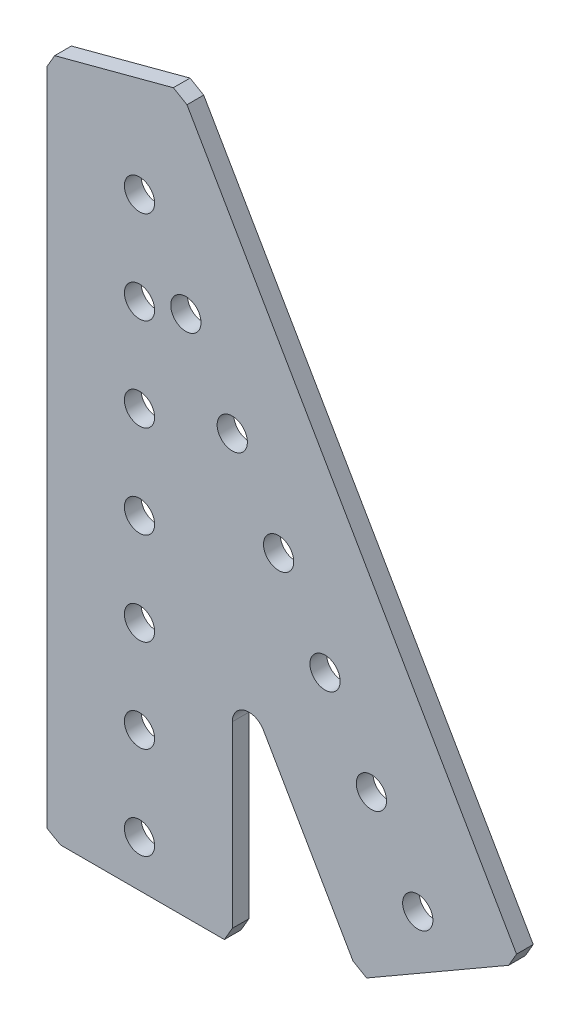
ISO-10303-21;
HEADER;
FILE_DESCRIPTION(('STEP AP214'),'2;1');
FILE_NAME('part.step','',(''),(''),'','','');
FILE_SCHEMA(('AUTOMOTIVE_DESIGN { 1 0 10303 214 1 1 1 1 }'));
ENDSEC;
DATA;
#1=APPLICATION_CONTEXT('core data for automotive mechanical design processes');
#2=APPLICATION_PROTOCOL_DEFINITION('international standard','automotive_design',2000,#1);
#3=PRODUCT_CONTEXT('',#1,'mechanical');
#4=PRODUCT('Part','Part','',(#3));
#5=PRODUCT_RELATED_PRODUCT_CATEGORY('part','',(#4));
#6=PRODUCT_DEFINITION_FORMATION('','',#4);
#7=PRODUCT_DEFINITION_CONTEXT('part definition',#1,'design');
#8=PRODUCT_DEFINITION('design','',#6,#7);
#9=PRODUCT_DEFINITION_SHAPE('','',#8);
#10=(LENGTH_UNIT() NAMED_UNIT(*) SI_UNIT(.MILLI.,.METRE.));
#11=(NAMED_UNIT(*) PLANE_ANGLE_UNIT() SI_UNIT($,.RADIAN.));
#12=(NAMED_UNIT(*) SI_UNIT($,.STERADIAN.) SOLID_ANGLE_UNIT());
#13=UNCERTAINTY_MEASURE_WITH_UNIT(LENGTH_MEASURE(1.E-05),#10,'distance_accuracy_value','');
#14=(GEOMETRIC_REPRESENTATION_CONTEXT(3) GLOBAL_UNCERTAINTY_ASSIGNED_CONTEXT((#13)) GLOBAL_UNIT_ASSIGNED_CONTEXT((#10,
#11,#12)) REPRESENTATION_CONTEXT('',''));
#15=CARTESIAN_POINT('',(0.,0.,0.));
#16=DIRECTION('',(0.,0.,1.));
#17=DIRECTION('',(1.,0.,0.));
#18=AXIS2_PLACEMENT_3D('',#15,#16,#17);
#19=CARTESIAN_POINT('',(52.1635374017813,-65.2038970824057,0.));
#20=DIRECTION('',(0.,0.,1.));
#21=DIRECTION('',(1.,0.,0.));
#22=AXIS2_PLACEMENT_3D('',#19,#20,#21);
#23=PLANE('',#22);
#24=DIRECTION('',(0.5,-0.866025403784438,0.));
#25=VECTOR('',#24,1.);
#26=CARTESIAN_POINT('',(-11.1085078543435,-6.41350000000027,0.));
#27=LINE('',#26,#25);
#28=CARTESIAN_POINT('',(16.9657340730513,-55.0395134022283,0.));
#29=VERTEX_POINT('',#28);
#30=CARTESIAN_POINT('',(29.2306376524861,-76.2829495517427,0.));
#31=VERTEX_POINT('',#30);
#32=EDGE_CURVE('E54',#29,#31,#27,.T.);
#33=ORIENTED_EDGE('',*,*,#32,.F.);
#34=CARTESIAN_POINT('',(14.986,-56.1825134022283,0.));
#35=DIRECTION('',(0.,0.,1.));
#36=DIRECTION('',(1.,0.,0.));
#37=AXIS2_PLACEMENT_3D('',#34,#35,#36);
#38=CIRCLE('',#37,2.286);
#39=CARTESIAN_POINT('',(12.7,-56.1825134022283,0.));
#40=VERTEX_POINT('',#39);
#41=EDGE_CURVE('E252',#29,#40,#38,.T.);
#42=ORIENTED_EDGE('',*,*,#41,.T.);
#43=DIRECTION('',(0.,1.,0.));
#44=VECTOR('',#43,1.);
#45=CARTESIAN_POINT('',(12.7,0.,0.));
#46=LINE('',#45,#44);
#47=CARTESIAN_POINT('',(12.7,-80.68221747697,0.));
#48=VERTEX_POINT('',#47);
#49=EDGE_CURVE('E60',#40,#48,#46,.F.);
#50=ORIENTED_EDGE('',*,*,#49,.T.);
#51=DIRECTION('',(-0.501574169410907,-0.865114647072721,0.));
#52=VECTOR('',#51,1.);
#53=CARTESIAN_POINT('',(44.5145366567396,-25.8085351182809,0.));
#54=LINE('',#53,#52);
#55=CARTESIAN_POINT('',(11.6171013682419,-82.55,0.));
#56=VERTEX_POINT('',#55);
#57=EDGE_CURVE('E154',#48,#56,#54,.T.);
#58=ORIENTED_EDGE('',*,*,#57,.T.);
#59=DIRECTION('',(-1.,0.,0.));
#60=VECTOR('',#59,1.);
#61=CARTESIAN_POINT('',(12.7,-82.55,0.));
#62=LINE('',#61,#60);
#63=CARTESIAN_POINT('',(-10.83221747697,-82.55,0.));
#64=VERTEX_POINT('',#63);
#65=EDGE_CURVE('E163',#56,#64,#62,.T.);
#66=ORIENTED_EDGE('',*,*,#65,.T.);
#67=DIRECTION('',(0.865114647072719,-0.501574169410911,0.));
#68=VECTOR('',#67,1.);
#69=CARTESIAN_POINT('',(-38.5451596604444,-66.4826544699684,0.));
#70=LINE('',#69,#68);
#71=CARTESIAN_POINT('',(-12.7,-81.4671013682419,0.));
#72=VERTEX_POINT('',#71);
#73=EDGE_CURVE('E169',#72,#64,#70,.T.);
#74=ORIENTED_EDGE('',*,*,#73,.F.);
#75=DIRECTION('',(0.,1.,0.));
#76=VECTOR('',#75,1.);
#77=CARTESIAN_POINT('',(-12.7,-82.55,0.));
#78=LINE('',#77,#76);
#79=CARTESIAN_POINT('',(-12.7,8.77953534918344,0.));
#80=VERTEX_POINT('',#79);
#81=EDGE_CURVE('E175',#72,#80,#78,.T.);
#82=ORIENTED_EDGE('',*,*,#81,.T.);
#83=DIRECTION('',(0.501574169410909,0.86511464707272,0.));
#84=VECTOR('',#83,1.);
#85=CARTESIAN_POINT('',(-13.3145851865059,7.71949940804912,0.));
#86=LINE('',#85,#84);
#87=CARTESIAN_POINT('',(-11.6171013682418,10.6473178722135,0.));
#88=VERTEX_POINT('',#87);
#89=EDGE_CURVE('E177',#80,#88,#86,.T.);
#90=ORIENTED_EDGE('',*,*,#89,.T.);
#91=DIRECTION('',(0.966394929907391,0.257061936990462,0.));
#92=VECTOR('',#91,1.);
#93=CARTESIAN_POINT('',(-12.7,10.359265843763,0.));
#94=LINE('',#93,#92);
#95=CARTESIAN_POINT('',(4.63267632701637,14.969773630966,0.));
#96=VERTEX_POINT('',#95);
#97=EDGE_CURVE('E185',#88,#96,#94,.T.);
#98=ORIENTED_EDGE('',*,*,#97,.T.);
#99=DIRECTION('',(0.86511464707272,-0.501574169410908,0.));
#100=VECTOR('',#99,1.);
#101=CARTESIAN_POINT('',(7.66114478651684,13.2139351911697,0.));
#102=LINE('',#101,#100);
#103=CARTESIAN_POINT('',(6.50045885004739,13.8868749992073,0.));
#104=VERTEX_POINT('',#103);
#105=EDGE_CURVE('E191',#96,#104,#102,.T.);
#106=ORIENTED_EDGE('',*,*,#105,.T.);
#107=DIRECTION('',(0.499999999999995,-0.866025403784442,0.));
#108=VECTOR('',#107,1.);
#109=CARTESIAN_POINT('',(5.70982341473581,15.2562957434313,0.));
#110=LINE('',#109,#108);
#111=CARTESIAN_POINT('',(51.6254885028765,-64.2719690525461,0.));
#112=VERTEX_POINT('',#111);
#113=EDGE_CURVE('E197',#104,#112,#110,.T.);
#114=ORIENTED_EDGE('',*,*,#113,.T.);
#115=DIRECTION('',(0.50157416941091,0.865114647072719,0.));
#116=VECTOR('',#115,1.);
#117=CARTESIAN_POINT('',(66.5265600421126,-38.5706151315258,0.));
#118=LINE('',#117,#116);
#119=CARTESIAN_POINT('',(50.5425898711182,-66.1397515755763,0.));
#120=VERTEX_POINT('',#119);
#121=EDGE_CURVE('E203',#120,#112,#118,.T.);
#122=ORIENTED_EDGE('',*,*,#121,.F.);
#123=DIRECTION('',(-0.866025403784442,-0.499999999999995,0.));
#124=VECTOR('',#123,1.);
#125=CARTESIAN_POINT('',(52.1635374017813,-65.2038970824057,0.));
#126=LINE('',#125,#124);
#127=CARTESIAN_POINT('',(31.098420175516,-77.3658481835008,0.));
#128=VERTEX_POINT('',#127);
#129=EDGE_CURVE('E122',#120,#128,#126,.T.);
#130=ORIENTED_EDGE('',*,*,#129,.T.);
#131=DIRECTION('',(0.865114647072715,-0.501574169410918,0.));
#132=VECTOR('',#131,1.);
#133=CARTESIAN_POINT('',(-25.7468876112562,-44.4082070956581,0.));
#134=LINE('',#133,#132);
#135=EDGE_CURVE('E124',#31,#128,#134,.T.);
#136=ORIENTED_EDGE('',*,*,#135,.F.);
#137=EDGE_LOOP('',(#33,#42,#50,#58,#66,#74,#82,#90,#98,#106,#114,#122,#130,#136));
#138=FACE_BOUND('',#137,.T.);
#139=CARTESIAN_POINT('',(38.0999999999996,-65.9911357683745,0.));
#140=DIRECTION('',(0.,0.,-1.));
#141=DIRECTION('',(-1.,0.,0.));
#142=AXIS2_PLACEMENT_3D('',#139,#140,#141);
#143=CIRCLE('',#142,2.0701);
#144=CARTESIAN_POINT('',(36.0298999999996,-65.9911357683745,0.));
#145=VERTEX_POINT('',#144);
#146=EDGE_CURVE('E137',#145,#145,#143,.F.);
#147=ORIENTED_EDGE('',*,*,#146,.T.);
#148=EDGE_LOOP('',(#147));
#149=FACE_BOUND('',#148,.T.);
#150=CARTESIAN_POINT('',(0.,-63.5,0.));
#151=DIRECTION('',(0.,0.,-1.));
#152=DIRECTION('',(-1.,0.,0.));
#153=AXIS2_PLACEMENT_3D('',#150,#151,#152);
#154=CIRCLE('',#153,2.0701);
#155=CARTESIAN_POINT('',(-2.07009999999999,-63.5,0.));
#156=VERTEX_POINT('',#155);
#157=EDGE_CURVE('E256',#156,#156,#154,.F.);
#158=ORIENTED_EDGE('',*,*,#157,.T.);
#159=EDGE_LOOP('',(#158));
#160=FACE_BOUND('',#159,.T.);
#161=CARTESIAN_POINT('',(25.3999999999997,-43.9940905122496,0.));
#162=DIRECTION('',(0.,0.,-1.));
#163=DIRECTION('',(-1.,0.,0.));
#164=AXIS2_PLACEMENT_3D('',#161,#162,#163);
#165=CIRCLE('',#164,2.0701);
#166=CARTESIAN_POINT('',(23.3298999999997,-43.9940905122496,0.));
#167=VERTEX_POINT('',#166);
#168=EDGE_CURVE('E259',#167,#167,#165,.F.);
#169=ORIENTED_EDGE('',*,*,#168,.T.);
#170=EDGE_LOOP('',(#169));
#171=FACE_BOUND('',#170,.T.);
#172=CARTESIAN_POINT('',(12.6999999999999,-21.9970452561248,0.));
#173=DIRECTION('',(0.,0.,-1.));
#174=DIRECTION('',(-1.,0.,0.));
#175=AXIS2_PLACEMENT_3D('',#172,#173,#174);
#176=CIRCLE('',#175,2.0701);
#177=CARTESIAN_POINT('',(10.6298999999999,-21.9970452561248,0.));
#178=VERTEX_POINT('',#177);
#179=EDGE_CURVE('E262',#178,#178,#176,.F.);
#180=ORIENTED_EDGE('',*,*,#179,.T.);
#181=EDGE_LOOP('',(#180));
#182=FACE_BOUND('',#181,.T.);
#183=CARTESIAN_POINT('',(3.9907631702977E-13,-38.1,0.));
#184=DIRECTION('',(0.,0.,-1.));
#185=DIRECTION('',(-1.,0.,0.));
#186=AXIS2_PLACEMENT_3D('',#183,#184,#185);
#187=CIRCLE('',#186,2.0701);
#188=CARTESIAN_POINT('',(-2.0700999999996,-38.1,0.));
#189=VERTEX_POINT('',#188);
#190=EDGE_CURVE('E265',#189,#189,#187,.F.);
#191=ORIENTED_EDGE('',*,*,#190,.T.);
#192=EDGE_LOOP('',(#191));
#193=FACE_BOUND('',#192,.T.);
#194=CARTESIAN_POINT('',(1.33025439009923E-13,-12.7,0.));
#195=DIRECTION('',(0.,0.,-1.));
#196=DIRECTION('',(-1.,0.,0.));
#197=AXIS2_PLACEMENT_3D('',#194,#195,#196);
#198=CIRCLE('',#197,2.0701);
#199=CARTESIAN_POINT('',(-2.07009999999987,-12.7,0.));
#200=VERTEX_POINT('',#199);
#201=EDGE_CURVE('E268',#200,#200,#198,.F.);
#202=ORIENTED_EDGE('',*,*,#201,.T.);
#203=EDGE_LOOP('',(#202));
#204=FACE_BOUND('',#203,.T.);
#205=CARTESIAN_POINT('',(0.,0.,0.));
#206=DIRECTION('',(0.,0.,-1.));
#207=DIRECTION('',(-1.,0.,0.));
#208=AXIS2_PLACEMENT_3D('',#205,#206,#207);
#209=CIRCLE('',#208,2.0701);
#210=CARTESIAN_POINT('',(-2.0701,0.,0.));
#211=VERTEX_POINT('',#210);
#212=EDGE_CURVE('E271',#211,#211,#209,.F.);
#213=ORIENTED_EDGE('',*,*,#212,.T.);
#214=EDGE_LOOP('',(#213));
#215=FACE_BOUND('',#214,.T.);
#216=CARTESIAN_POINT('',(6.34999999999993,-10.9985226280624,0.));
#217=DIRECTION('',(0.,0.,-1.));
#218=DIRECTION('',(-1.,0.,0.));
#219=AXIS2_PLACEMENT_3D('',#216,#217,#218);
#220=CIRCLE('',#219,2.0701);
#221=CARTESIAN_POINT('',(4.27989999999993,-10.9985226280624,0.));
#222=VERTEX_POINT('',#221);
#223=EDGE_CURVE('E274',#222,#222,#220,.F.);
#224=ORIENTED_EDGE('',*,*,#223,.T.);
#225=EDGE_LOOP('',(#224));
#226=FACE_BOUND('',#225,.T.);
#227=CARTESIAN_POINT('',(2.66050878019847E-13,-25.4,0.));
#228=DIRECTION('',(0.,0.,-1.));
#229=DIRECTION('',(-1.,0.,0.));
#230=AXIS2_PLACEMENT_3D('',#227,#228,#229);
#231=CIRCLE('',#230,2.0701);
#232=CARTESIAN_POINT('',(-2.07009999999973,-25.4,0.));
#233=VERTEX_POINT('',#232);
#234=EDGE_CURVE('E277',#233,#233,#231,.F.);
#235=ORIENTED_EDGE('',*,*,#234,.T.);
#236=EDGE_LOOP('',(#235));
#237=FACE_BOUND('',#236,.T.);
#238=CARTESIAN_POINT('',(0.,-50.8,0.));
#239=DIRECTION('',(0.,0.,-1.));
#240=DIRECTION('',(-1.,0.,0.));
#241=AXIS2_PLACEMENT_3D('',#238,#239,#240);
#242=CIRCLE('',#241,2.0701);
#243=CARTESIAN_POINT('',(-2.07009999999999,-50.8,0.));
#244=VERTEX_POINT('',#243);
#245=EDGE_CURVE('E280',#244,#244,#242,.F.);
#246=ORIENTED_EDGE('',*,*,#245,.T.);
#247=EDGE_LOOP('',(#246));
#248=FACE_BOUND('',#247,.T.);
#249=CARTESIAN_POINT('',(19.0499999999998,-32.9955678841872,0.));
#250=DIRECTION('',(0.,0.,-1.));
#251=DIRECTION('',(-1.,0.,0.));
#252=AXIS2_PLACEMENT_3D('',#249,#250,#251);
#253=CIRCLE('',#252,2.0701);
#254=CARTESIAN_POINT('',(16.9798999999998,-32.9955678841872,0.));
#255=VERTEX_POINT('',#254);
#256=EDGE_CURVE('E283',#255,#255,#253,.F.);
#257=ORIENTED_EDGE('',*,*,#256,.T.);
#258=EDGE_LOOP('',(#257));
#259=FACE_BOUND('',#258,.T.);
#260=CARTESIAN_POINT('',(31.7499999999996,-54.992613140312,0.));
#261=DIRECTION('',(0.,0.,-1.));
#262=DIRECTION('',(-1.,0.,0.));
#263=AXIS2_PLACEMENT_3D('',#260,#261,#262);
#264=CIRCLE('',#263,2.0701);
#265=CARTESIAN_POINT('',(29.6798999999996,-54.992613140312,0.));
#266=VERTEX_POINT('',#265);
#267=EDGE_CURVE('E285',#266,#266,#264,.F.);
#268=ORIENTED_EDGE('',*,*,#267,.T.);
#269=EDGE_LOOP('',(#268));
#270=FACE_BOUND('',#269,.T.);
#271=CARTESIAN_POINT('',(0.,-76.2,0.));
#272=DIRECTION('',(0.,0.,-1.));
#273=DIRECTION('',(-1.,0.,0.));
#274=AXIS2_PLACEMENT_3D('',#271,#272,#273);
#275=CIRCLE('',#274,2.0701);
#276=CARTESIAN_POINT('',(-2.07009999999999,-76.2,0.));
#277=VERTEX_POINT('',#276);
#278=EDGE_CURVE('E20',#277,#277,#275,.F.);
#279=ORIENTED_EDGE('',*,*,#278,.T.);
#280=EDGE_LOOP('',(#279));
#281=FACE_BOUND('',#280,.T.);
#282=ADVANCED_FACE('F17',(#138,#149,#160,#171,#182,#193,#204,#215,#226,#237,#248,#259,#270,
#281),#23,.F.);
#283=CARTESIAN_POINT('',(0.,-76.2,2.286));
#284=DIRECTION('',(0.,0.,-1.));
#285=DIRECTION('',(-1.,0.,0.));
#286=AXIS2_PLACEMENT_3D('',#283,#284,#285);
#287=CYLINDRICAL_SURFACE('',#286,2.0701);
#288=CARTESIAN_POINT('',(0.,-76.2,2.286));
#289=DIRECTION('',(0.,0.,-1.));
#290=DIRECTION('',(-1.,0.,0.));
#291=AXIS2_PLACEMENT_3D('',#288,#289,#290);
#292=CIRCLE('',#291,2.0701);
#293=CARTESIAN_POINT('',(-2.07009999999999,-76.2,2.286));
#294=VERTEX_POINT('',#293);
#295=EDGE_CURVE('E249',#294,#294,#292,.T.);
#296=ORIENTED_EDGE('',*,*,#295,.F.);
#297=EDGE_LOOP('',(#296));
#298=FACE_BOUND('',#297,.T.);
#299=ORIENTED_EDGE('',*,*,#278,.F.);
#300=EDGE_LOOP('',(#299));
#301=FACE_BOUND('',#300,.T.);
#302=ADVANCED_FACE('F293',(#298,#301),#287,.F.);
#303=CARTESIAN_POINT('',(31.7499999999996,-54.992613140312,2.286));
#304=DIRECTION('',(0.,0.,-1.));
#305=DIRECTION('',(-1.,0.,0.));
#306=AXIS2_PLACEMENT_3D('',#303,#304,#305);
#307=CYLINDRICAL_SURFACE('',#306,2.0701);
#308=CARTESIAN_POINT('',(31.7499999999996,-54.992613140312,2.286));
#309=DIRECTION('',(0.,0.,-1.));
#310=DIRECTION('',(-1.,0.,0.));
#311=AXIS2_PLACEMENT_3D('',#308,#309,#310);
#312=CIRCLE('',#311,2.0701);
#313=CARTESIAN_POINT('',(29.6798999999996,-54.992613140312,2.286));
#314=VERTEX_POINT('',#313);
#315=EDGE_CURVE('E246',#314,#314,#312,.T.);
#316=ORIENTED_EDGE('',*,*,#315,.F.);
#317=EDGE_LOOP('',(#316));
#318=FACE_BOUND('',#317,.T.);
#319=ORIENTED_EDGE('',*,*,#267,.F.);
#320=EDGE_LOOP('',(#319));
#321=FACE_BOUND('',#320,.T.);
#322=ADVANCED_FACE('F295',(#318,#321),#307,.F.);
#323=CARTESIAN_POINT('',(19.0499999999998,-32.9955678841872,2.286));
#324=DIRECTION('',(0.,0.,-1.));
#325=DIRECTION('',(-1.,0.,0.));
#326=AXIS2_PLACEMENT_3D('',#323,#324,#325);
#327=CYLINDRICAL_SURFACE('',#326,2.0701);
#328=CARTESIAN_POINT('',(19.0499999999998,-32.9955678841872,2.286));
#329=DIRECTION('',(0.,0.,-1.));
#330=DIRECTION('',(-1.,0.,0.));
#331=AXIS2_PLACEMENT_3D('',#328,#329,#330);
#332=CIRCLE('',#331,2.0701);
#333=CARTESIAN_POINT('',(16.9798999999998,-32.9955678841872,2.286));
#334=VERTEX_POINT('',#333);
#335=EDGE_CURVE('E243',#334,#334,#332,.T.);
#336=ORIENTED_EDGE('',*,*,#335,.F.);
#337=EDGE_LOOP('',(#336));
#338=FACE_BOUND('',#337,.T.);
#339=ORIENTED_EDGE('',*,*,#256,.F.);
#340=EDGE_LOOP('',(#339));
#341=FACE_BOUND('',#340,.T.);
#342=ADVANCED_FACE('F302',(#338,#341),#327,.F.);
#343=CARTESIAN_POINT('',(0.,-50.8,2.286));
#344=DIRECTION('',(0.,0.,-1.));
#345=DIRECTION('',(-1.,0.,0.));
#346=AXIS2_PLACEMENT_3D('',#343,#344,#345);
#347=CYLINDRICAL_SURFACE('',#346,2.0701);
#348=CARTESIAN_POINT('',(0.,-50.8,2.286));
#349=DIRECTION('',(0.,0.,-1.));
#350=DIRECTION('',(-1.,0.,0.));
#351=AXIS2_PLACEMENT_3D('',#348,#349,#350);
#352=CIRCLE('',#351,2.0701);
#353=CARTESIAN_POINT('',(-2.07009999999999,-50.8,2.286));
#354=VERTEX_POINT('',#353);
#355=EDGE_CURVE('E240',#354,#354,#352,.T.);
#356=ORIENTED_EDGE('',*,*,#355,.F.);
#357=EDGE_LOOP('',(#356));
#358=FACE_BOUND('',#357,.T.);
#359=ORIENTED_EDGE('',*,*,#245,.F.);
#360=EDGE_LOOP('',(#359));
#361=FACE_BOUND('',#360,.T.);
#362=ADVANCED_FACE('F401',(#358,#361),#347,.F.);
#363=CARTESIAN_POINT('',(2.66050878019847E-13,-25.4,2.286));
#364=DIRECTION('',(0.,0.,-1.));
#365=DIRECTION('',(-1.,0.,0.));
#366=AXIS2_PLACEMENT_3D('',#363,#364,#365);
#367=CYLINDRICAL_SURFACE('',#366,2.0701);
#368=CARTESIAN_POINT('',(2.66050878019847E-13,-25.4,2.286));
#369=DIRECTION('',(0.,0.,-1.));
#370=DIRECTION('',(-1.,0.,0.));
#371=AXIS2_PLACEMENT_3D('',#368,#369,#370);
#372=CIRCLE('',#371,2.0701);
#373=CARTESIAN_POINT('',(-2.07009999999973,-25.4,2.286));
#374=VERTEX_POINT('',#373);
#375=EDGE_CURVE('E237',#374,#374,#372,.T.);
#376=ORIENTED_EDGE('',*,*,#375,.F.);
#377=EDGE_LOOP('',(#376));
#378=FACE_BOUND('',#377,.T.);
#379=ORIENTED_EDGE('',*,*,#234,.F.);
#380=EDGE_LOOP('',(#379));
#381=FACE_BOUND('',#380,.T.);
#382=ADVANCED_FACE('F397',(#378,#381),#367,.F.);
#383=CARTESIAN_POINT('',(6.34999999999993,-10.9985226280624,2.286));
#384=DIRECTION('',(0.,0.,-1.));
#385=DIRECTION('',(-1.,0.,0.));
#386=AXIS2_PLACEMENT_3D('',#383,#384,#385);
#387=CYLINDRICAL_SURFACE('',#386,2.0701);
#388=CARTESIAN_POINT('',(6.34999999999993,-10.9985226280624,2.286));
#389=DIRECTION('',(0.,0.,-1.));
#390=DIRECTION('',(-1.,0.,0.));
#391=AXIS2_PLACEMENT_3D('',#388,#389,#390);
#392=CIRCLE('',#391,2.0701);
#393=CARTESIAN_POINT('',(4.27989999999993,-10.9985226280624,2.286));
#394=VERTEX_POINT('',#393);
#395=EDGE_CURVE('E234',#394,#394,#392,.T.);
#396=ORIENTED_EDGE('',*,*,#395,.F.);
#397=EDGE_LOOP('',(#396));
#398=FACE_BOUND('',#397,.T.);
#399=ORIENTED_EDGE('',*,*,#223,.F.);
#400=EDGE_LOOP('',(#399));
#401=FACE_BOUND('',#400,.T.);
#402=ADVANCED_FACE('F393',(#398,#401),#387,.F.);
#403=CARTESIAN_POINT('',(0.,0.,2.286));
#404=DIRECTION('',(0.,0.,-1.));
#405=DIRECTION('',(-1.,0.,0.));
#406=AXIS2_PLACEMENT_3D('',#403,#404,#405);
#407=CYLINDRICAL_SURFACE('',#406,2.0701);
#408=CARTESIAN_POINT('',(0.,0.,2.286));
#409=DIRECTION('',(0.,0.,-1.));
#410=DIRECTION('',(-1.,0.,0.));
#411=AXIS2_PLACEMENT_3D('',#408,#409,#410);
#412=CIRCLE('',#411,2.0701);
#413=CARTESIAN_POINT('',(-2.0701,0.,2.286));
#414=VERTEX_POINT('',#413);
#415=EDGE_CURVE('E231',#414,#414,#412,.T.);
#416=ORIENTED_EDGE('',*,*,#415,.F.);
#417=EDGE_LOOP('',(#416));
#418=FACE_BOUND('',#417,.T.);
#419=ORIENTED_EDGE('',*,*,#212,.F.);
#420=EDGE_LOOP('',(#419));
#421=FACE_BOUND('',#420,.T.);
#422=ADVANCED_FACE('F389',(#418,#421),#407,.F.);
#423=CARTESIAN_POINT('',(1.33025439009923E-13,-12.7,2.286));
#424=DIRECTION('',(0.,0.,-1.));
#425=DIRECTION('',(-1.,0.,0.));
#426=AXIS2_PLACEMENT_3D('',#423,#424,#425);
#427=CYLINDRICAL_SURFACE('',#426,2.0701);
#428=CARTESIAN_POINT('',(1.33025439009923E-13,-12.7,2.286));
#429=DIRECTION('',(0.,0.,-1.));
#430=DIRECTION('',(-1.,0.,0.));
#431=AXIS2_PLACEMENT_3D('',#428,#429,#430);
#432=CIRCLE('',#431,2.0701);
#433=CARTESIAN_POINT('',(-2.07009999999987,-12.7,2.286));
#434=VERTEX_POINT('',#433);
#435=EDGE_CURVE('E228',#434,#434,#432,.T.);
#436=ORIENTED_EDGE('',*,*,#435,.F.);
#437=EDGE_LOOP('',(#436));
#438=FACE_BOUND('',#437,.T.);
#439=ORIENTED_EDGE('',*,*,#201,.F.);
#440=EDGE_LOOP('',(#439));
#441=FACE_BOUND('',#440,.T.);
#442=ADVANCED_FACE('F385',(#438,#441),#427,.F.);
#443=CARTESIAN_POINT('',(3.9907631702977E-13,-38.1,2.286));
#444=DIRECTION('',(0.,0.,-1.));
#445=DIRECTION('',(-1.,0.,0.));
#446=AXIS2_PLACEMENT_3D('',#443,#444,#445);
#447=CYLINDRICAL_SURFACE('',#446,2.0701);
#448=CARTESIAN_POINT('',(3.9907631702977E-13,-38.1,2.286));
#449=DIRECTION('',(0.,0.,-1.));
#450=DIRECTION('',(-1.,0.,0.));
#451=AXIS2_PLACEMENT_3D('',#448,#449,#450);
#452=CIRCLE('',#451,2.0701);
#453=CARTESIAN_POINT('',(-2.0700999999996,-38.1,2.286));
#454=VERTEX_POINT('',#453);
#455=EDGE_CURVE('E225',#454,#454,#452,.T.);
#456=ORIENTED_EDGE('',*,*,#455,.F.);
#457=EDGE_LOOP('',(#456));
#458=FACE_BOUND('',#457,.T.);
#459=ORIENTED_EDGE('',*,*,#190,.F.);
#460=EDGE_LOOP('',(#459));
#461=FACE_BOUND('',#460,.T.);
#462=ADVANCED_FACE('F381',(#458,#461),#447,.F.);
#463=CARTESIAN_POINT('',(12.6999999999999,-21.9970452561248,2.286));
#464=DIRECTION('',(0.,0.,-1.));
#465=DIRECTION('',(-1.,0.,0.));
#466=AXIS2_PLACEMENT_3D('',#463,#464,#465);
#467=CYLINDRICAL_SURFACE('',#466,2.0701);
#468=CARTESIAN_POINT('',(12.6999999999999,-21.9970452561248,2.286));
#469=DIRECTION('',(0.,0.,-1.));
#470=DIRECTION('',(-1.,0.,0.));
#471=AXIS2_PLACEMENT_3D('',#468,#469,#470);
#472=CIRCLE('',#471,2.0701);
#473=CARTESIAN_POINT('',(10.6298999999999,-21.9970452561248,2.286));
#474=VERTEX_POINT('',#473);
#475=EDGE_CURVE('E222',#474,#474,#472,.T.);
#476=ORIENTED_EDGE('',*,*,#475,.F.);
#477=EDGE_LOOP('',(#476));
#478=FACE_BOUND('',#477,.T.);
#479=ORIENTED_EDGE('',*,*,#179,.F.);
#480=EDGE_LOOP('',(#479));
#481=FACE_BOUND('',#480,.T.);
#482=ADVANCED_FACE('F377',(#478,#481),#467,.F.);
#483=CARTESIAN_POINT('',(25.3999999999997,-43.9940905122496,2.286));
#484=DIRECTION('',(0.,0.,-1.));
#485=DIRECTION('',(-1.,0.,0.));
#486=AXIS2_PLACEMENT_3D('',#483,#484,#485);
#487=CYLINDRICAL_SURFACE('',#486,2.0701);
#488=CARTESIAN_POINT('',(25.3999999999997,-43.9940905122496,2.286));
#489=DIRECTION('',(0.,0.,-1.));
#490=DIRECTION('',(-1.,0.,0.));
#491=AXIS2_PLACEMENT_3D('',#488,#489,#490);
#492=CIRCLE('',#491,2.0701);
#493=CARTESIAN_POINT('',(23.3298999999997,-43.9940905122496,2.286));
#494=VERTEX_POINT('',#493);
#495=EDGE_CURVE('E219',#494,#494,#492,.T.);
#496=ORIENTED_EDGE('',*,*,#495,.F.);
#497=EDGE_LOOP('',(#496));
#498=FACE_BOUND('',#497,.T.);
#499=ORIENTED_EDGE('',*,*,#168,.F.);
#500=EDGE_LOOP('',(#499));
#501=FACE_BOUND('',#500,.T.);
#502=ADVANCED_FACE('F373',(#498,#501),#487,.F.);
#503=CARTESIAN_POINT('',(0.,-63.5,2.286));
#504=DIRECTION('',(0.,0.,-1.));
#505=DIRECTION('',(-1.,0.,0.));
#506=AXIS2_PLACEMENT_3D('',#503,#504,#505);
#507=CYLINDRICAL_SURFACE('',#506,2.0701);
#508=CARTESIAN_POINT('',(0.,-63.5,2.286));
#509=DIRECTION('',(0.,0.,-1.));
#510=DIRECTION('',(-1.,0.,0.));
#511=AXIS2_PLACEMENT_3D('',#508,#509,#510);
#512=CIRCLE('',#511,2.0701);
#513=CARTESIAN_POINT('',(-2.07009999999999,-63.5,2.286));
#514=VERTEX_POINT('',#513);
#515=EDGE_CURVE('E216',#514,#514,#512,.T.);
#516=ORIENTED_EDGE('',*,*,#515,.F.);
#517=EDGE_LOOP('',(#516));
#518=FACE_BOUND('',#517,.T.);
#519=ORIENTED_EDGE('',*,*,#157,.F.);
#520=EDGE_LOOP('',(#519));
#521=FACE_BOUND('',#520,.T.);
#522=ADVANCED_FACE('F369',(#518,#521),#507,.F.);
#523=CARTESIAN_POINT('',(38.0999999999996,-65.9911357683745,2.286));
#524=DIRECTION('',(0.,0.,-1.));
#525=DIRECTION('',(-1.,0.,0.));
#526=AXIS2_PLACEMENT_3D('',#523,#524,#525);
#527=CYLINDRICAL_SURFACE('',#526,2.0701);
#528=CARTESIAN_POINT('',(38.0999999999996,-65.9911357683745,2.286));
#529=DIRECTION('',(0.,0.,-1.));
#530=DIRECTION('',(-1.,0.,0.));
#531=AXIS2_PLACEMENT_3D('',#528,#529,#530);
#532=CIRCLE('',#531,2.0701);
#533=CARTESIAN_POINT('',(36.0298999999996,-65.9911357683745,2.286));
#534=VERTEX_POINT('',#533);
#535=EDGE_CURVE('E212',#534,#534,#532,.T.);
#536=ORIENTED_EDGE('',*,*,#535,.F.);
#537=EDGE_LOOP('',(#536));
#538=FACE_BOUND('',#537,.T.);
#539=ORIENTED_EDGE('',*,*,#146,.F.);
#540=EDGE_LOOP('',(#539));
#541=FACE_BOUND('',#540,.T.);
#542=ADVANCED_FACE('F366',(#538,#541),#527,.F.);
#543=CARTESIAN_POINT('',(-11.1085078543435,-6.41350000000027,0.));
#544=DIRECTION('',(-0.866025403784438,-0.5,0.));
#545=DIRECTION('',(0.5,-0.866025403784438,0.));
#546=AXIS2_PLACEMENT_3D('',#543,#544,#545);
#547=PLANE('',#546);
#548=DIRECTION('',(0.500000000000001,-0.866025403784438,0.));
#549=VECTOR('',#548,1.);
#550=CARTESIAN_POINT('',(16.9657340730512,-55.0395134022283,2.286));
#551=LINE('',#550,#549);
#552=CARTESIAN_POINT('',(16.9657340730512,-55.0395134022283,2.286));
#553=VERTEX_POINT('',#552);
#554=CARTESIAN_POINT('',(29.230637652486,-76.2829495517427,2.286));
#555=VERTEX_POINT('',#554);
#556=EDGE_CURVE('E215',#553,#555,#551,.T.);
#557=ORIENTED_EDGE('',*,*,#556,.F.);
#558=DIRECTION('',(0.,0.,1.));
#559=VECTOR('',#558,1.);
#560=CARTESIAN_POINT('',(16.9657340730512,-55.0395134022283,0.));
#561=LINE('',#560,#559);
#562=EDGE_CURVE('E135',#553,#29,#561,.F.);
#563=ORIENTED_EDGE('',*,*,#562,.T.);
#564=ORIENTED_EDGE('',*,*,#32,.T.);
#565=DIRECTION('',(0.,0.,1.));
#566=VECTOR('',#565,1.);
#567=CARTESIAN_POINT('',(29.2306376524861,-76.2829495517427,2.286));
#568=LINE('',#567,#566);
#569=EDGE_CURVE('E129',#555,#31,#568,.F.);
#570=ORIENTED_EDGE('',*,*,#569,.F.);
#571=EDGE_LOOP('',(#557,#563,#564,#570));
#572=FACE_BOUND('',#571,.T.);
#573=ADVANCED_FACE('F132',(#572),#547,.T.);
#574=CARTESIAN_POINT('',(-25.7468876112562,-44.4082070956581,2.286));
#575=DIRECTION('',(-0.501574169410918,-0.865114647072715,0.));
#576=DIRECTION('',(0.865114647072715,-0.501574169410918,0.));
#577=AXIS2_PLACEMENT_3D('',#574,#575,#576);
#578=PLANE('',#577);
#579=DIRECTION('',(0.865114647072718,-0.501574169410912,0.));
#580=VECTOR('',#579,1.);
#581=CARTESIAN_POINT('',(29.230637652486,-76.2829495517427,2.286));
#582=LINE('',#581,#580);
#583=CARTESIAN_POINT('',(31.098420175516,-77.3658481835008,2.286));
#584=VERTEX_POINT('',#583);
#585=EDGE_CURVE('E141',#555,#584,#582,.T.);
#586=ORIENTED_EDGE('',*,*,#585,.F.);
#587=ORIENTED_EDGE('',*,*,#569,.T.);
#588=ORIENTED_EDGE('',*,*,#135,.T.);
#589=DIRECTION('',(0.,0.,1.));
#590=VECTOR('',#589,1.);
#591=CARTESIAN_POINT('',(31.098420175516,-77.3658481835008,2.286));
#592=LINE('',#591,#590);
#593=EDGE_CURVE('E144',#128,#584,#592,.T.);
#594=ORIENTED_EDGE('',*,*,#593,.T.);
#595=EDGE_LOOP('',(#586,#587,#588,#594));
#596=FACE_BOUND('',#595,.T.);
#597=ADVANCED_FACE('F139',(#596),#578,.T.);
#598=CARTESIAN_POINT('',(52.1635374017813,-65.2038970824057,2.286));
#599=DIRECTION('',(-0.499999999999995,0.866025403784442,0.));
#600=DIRECTION('',(-0.866025403784442,-0.499999999999995,0.));
#601=AXIS2_PLACEMENT_3D('',#598,#599,#600);
#602=PLANE('',#601);
#603=ORIENTED_EDGE('',*,*,#129,.F.);
#604=DIRECTION('',(0.,0.,1.));
#605=VECTOR('',#604,1.);
#606=CARTESIAN_POINT('',(50.5425898711182,-66.1397515755763,2.286));
#607=LINE('',#606,#605);
#608=CARTESIAN_POINT('',(50.5425898711182,-66.1397515755763,2.286));
#609=VERTEX_POINT('',#608);
#610=EDGE_CURVE('E200',#609,#120,#607,.F.);
#611=ORIENTED_EDGE('',*,*,#610,.F.);
#612=DIRECTION('',(0.866025403784442,0.499999999999995,0.));
#613=VECTOR('',#612,1.);
#614=CARTESIAN_POINT('',(31.098420175516,-77.3658481835009,2.286));
#615=LINE('',#614,#613);
#616=EDGE_CURVE('E659',#584,#609,#615,.T.);
#617=ORIENTED_EDGE('',*,*,#616,.F.);
#618=ORIENTED_EDGE('',*,*,#593,.F.);
#619=EDGE_LOOP('',(#603,#611,#617,#618));
#620=FACE_BOUND('',#619,.T.);
#621=ADVANCED_FACE('F357',(#620),#602,.F.);
#622=CARTESIAN_POINT('',(66.5265600421126,-38.5706151315258,2.286));
#623=DIRECTION('',(0.865114647072719,-0.50157416941091,0.));
#624=DIRECTION('',(0.50157416941091,0.865114647072719,0.));
#625=AXIS2_PLACEMENT_3D('',#622,#623,#624);
#626=PLANE('',#625);
#627=DIRECTION('',(0.501574169410902,0.865114647072724,0.));
#628=VECTOR('',#627,1.);
#629=CARTESIAN_POINT('',(50.5425898711182,-66.1397515755763,2.286));
#630=LINE('',#629,#628);
#631=CARTESIAN_POINT('',(51.6254885028765,-64.2719690525461,2.286));
#632=VERTEX_POINT('',#631);
#633=EDGE_CURVE('E650',#609,#632,#630,.T.);
#634=ORIENTED_EDGE('',*,*,#633,.F.);
#635=ORIENTED_EDGE('',*,*,#610,.T.);
#636=ORIENTED_EDGE('',*,*,#121,.T.);
#637=DIRECTION('',(0.,0.,1.));
#638=VECTOR('',#637,1.);
#639=CARTESIAN_POINT('',(51.6254885028765,-64.2719690525461,2.286));
#640=LINE('',#639,#638);
#641=EDGE_CURVE('E199',#112,#632,#640,.T.);
#642=ORIENTED_EDGE('',*,*,#641,.T.);
#643=EDGE_LOOP('',(#634,#635,#636,#642));
#644=FACE_BOUND('',#643,.T.);
#645=ADVANCED_FACE('F353',(#644),#626,.T.);
#646=CARTESIAN_POINT('',(5.70982341473581,15.2562957434313,2.286));
#647=DIRECTION('',(-0.866025403784442,-0.499999999999995,0.));
#648=DIRECTION('',(0.499999999999995,-0.866025403784442,0.));
#649=AXIS2_PLACEMENT_3D('',#646,#647,#648);
#650=PLANE('',#649);
#651=ORIENTED_EDGE('',*,*,#113,.F.);
#652=DIRECTION('',(0.,0.,1.));
#653=VECTOR('',#652,1.);
#654=CARTESIAN_POINT('',(6.50045885004739,13.8868749992073,2.286));
#655=LINE('',#654,#653);
#656=CARTESIAN_POINT('',(6.50045885004743,13.8868749992072,2.286));
#657=VERTEX_POINT('',#656);
#658=EDGE_CURVE('E194',#104,#657,#655,.T.);
#659=ORIENTED_EDGE('',*,*,#658,.T.);
#660=DIRECTION('',(-0.499999999999994,0.866025403784442,0.));
#661=VECTOR('',#660,1.);
#662=CARTESIAN_POINT('',(51.6254885028765,-64.2719690525461,2.286));
#663=LINE('',#662,#661);
#664=EDGE_CURVE('E729',#632,#657,#663,.T.);
#665=ORIENTED_EDGE('',*,*,#664,.F.);
#666=ORIENTED_EDGE('',*,*,#641,.F.);
#667=EDGE_LOOP('',(#651,#659,#665,#666));
#668=FACE_BOUND('',#667,.T.);
#669=ADVANCED_FACE('F349',(#668),#650,.F.);
#670=CARTESIAN_POINT('',(7.66114478651684,13.2139351911697,2.286));
#671=DIRECTION('',(-0.501574169410908,-0.86511464707272,0.));
#672=DIRECTION('',(0.86511464707272,-0.501574169410908,0.));
#673=AXIS2_PLACEMENT_3D('',#670,#671,#672);
#674=PLANE('',#673);
#675=DIRECTION('',(0.,0.,1.));
#676=VECTOR('',#675,1.);
#677=CARTESIAN_POINT('',(4.63267632701637,14.969773630966,2.286));
#678=LINE('',#677,#676);
#679=CARTESIAN_POINT('',(4.63267632701636,14.969773630966,2.286));
#680=VERTEX_POINT('',#679);
#681=EDGE_CURVE('E188',#96,#680,#678,.T.);
#682=ORIENTED_EDGE('',*,*,#681,.T.);
#683=DIRECTION('',(-0.865114647072722,0.501574169410906,0.));
#684=VECTOR('',#683,1.);
#685=CARTESIAN_POINT('',(6.50045885004739,13.8868749992073,2.286));
#686=LINE('',#685,#684);
#687=EDGE_CURVE('E721',#657,#680,#686,.T.);
#688=ORIENTED_EDGE('',*,*,#687,.F.);
#689=ORIENTED_EDGE('',*,*,#658,.F.);
#690=ORIENTED_EDGE('',*,*,#105,.F.);
#691=EDGE_LOOP('',(#682,#688,#689,#690));
#692=FACE_BOUND('',#691,.T.);
#693=ADVANCED_FACE('F345',(#692),#674,.F.);
#694=CARTESIAN_POINT('',(-12.7,10.359265843763,2.286));
#695=DIRECTION('',(0.257061936990462,-0.966394929907391,0.));
#696=DIRECTION('',(0.966394929907391,0.257061936990462,0.));
#697=AXIS2_PLACEMENT_3D('',#694,#695,#696);
#698=PLANE('',#697);
#699=DIRECTION('',(0.,0.,1.));
#700=VECTOR('',#699,1.);
#701=CARTESIAN_POINT('',(-11.6171013682418,10.6473178722135,2.286));
#702=LINE('',#701,#700);
#703=CARTESIAN_POINT('',(-11.6171013682418,10.6473178722135,2.286));
#704=VERTEX_POINT('',#703);
#705=EDGE_CURVE('E182',#88,#704,#702,.T.);
#706=ORIENTED_EDGE('',*,*,#705,.T.);
#707=DIRECTION('',(-0.966394929907391,-0.257061936990462,0.));
#708=VECTOR('',#707,1.);
#709=CARTESIAN_POINT('',(4.63267632701636,14.969773630966,2.286));
#710=LINE('',#709,#708);
#711=EDGE_CURVE('E713',#680,#704,#710,.T.);
#712=ORIENTED_EDGE('',*,*,#711,.F.);
#713=ORIENTED_EDGE('',*,*,#681,.F.);
#714=ORIENTED_EDGE('',*,*,#97,.F.);
#715=EDGE_LOOP('',(#706,#712,#713,#714));
#716=FACE_BOUND('',#715,.T.);
#717=ADVANCED_FACE('F341',(#716),#698,.F.);
#718=CARTESIAN_POINT('',(-13.3145851865059,7.71949940804912,2.286));
#719=DIRECTION('',(0.86511464707272,-0.501574169410909,0.));
#720=DIRECTION('',(0.501574169410909,0.86511464707272,0.));
#721=AXIS2_PLACEMENT_3D('',#718,#719,#720);
#722=PLANE('',#721);
#723=DIRECTION('',(0.,0.,1.));
#724=VECTOR('',#723,1.);
#725=CARTESIAN_POINT('',(-12.7,8.77953534918344,2.286));
#726=LINE('',#725,#724);
#727=CARTESIAN_POINT('',(-12.7,8.77953534918344,2.286));
#728=VERTEX_POINT('',#727);
#729=EDGE_CURVE('E172',#80,#728,#726,.T.);
#730=ORIENTED_EDGE('',*,*,#729,.T.);
#731=DIRECTION('',(-0.501574169410905,-0.865114647072722,0.));
#732=VECTOR('',#731,1.);
#733=CARTESIAN_POINT('',(-11.6171013682418,10.6473178722135,2.286));
#734=LINE('',#733,#732);
#735=EDGE_CURVE('E705',#704,#728,#734,.T.);
#736=ORIENTED_EDGE('',*,*,#735,.F.);
#737=ORIENTED_EDGE('',*,*,#705,.F.);
#738=ORIENTED_EDGE('',*,*,#89,.F.);
#739=EDGE_LOOP('',(#730,#736,#737,#738));
#740=FACE_BOUND('',#739,.T.);
#741=ADVANCED_FACE('F337',(#740),#722,.F.);
#742=CARTESIAN_POINT('',(-12.7,-82.55,2.286));
#743=DIRECTION('',(1.,0.,0.));
#744=DIRECTION('',(0.,1.,0.));
#745=AXIS2_PLACEMENT_3D('',#742,#743,#744);
#746=PLANE('',#745);
#747=DIRECTION('',(0.,1.,0.));
#748=VECTOR('',#747,1.);
#749=CARTESIAN_POINT('',(-12.7,-65.2038970824057,2.286));
#750=LINE('',#749,#748);
#751=CARTESIAN_POINT('',(-12.7,-81.4671013682419,2.286));
#752=VERTEX_POINT('',#751);
#753=EDGE_CURVE('E696',#728,#752,#750,.F.);
#754=ORIENTED_EDGE('',*,*,#753,.F.);
#755=ORIENTED_EDGE('',*,*,#729,.F.);
#756=ORIENTED_EDGE('',*,*,#81,.F.);
#757=DIRECTION('',(0.,0.,1.));
#758=VECTOR('',#757,1.);
#759=CARTESIAN_POINT('',(-12.7,-81.4671013682419,2.286));
#760=LINE('',#759,#758);
#761=EDGE_CURVE('E171',#752,#72,#760,.F.);
#762=ORIENTED_EDGE('',*,*,#761,.F.);
#763=EDGE_LOOP('',(#754,#755,#756,#762));
#764=FACE_BOUND('',#763,.T.);
#765=ADVANCED_FACE('F333',(#764),#746,.F.);
#766=CARTESIAN_POINT('',(-38.5451596604444,-66.4826544699684,2.286));
#767=DIRECTION('',(-0.501574169410911,-0.865114647072719,0.));
#768=DIRECTION('',(0.865114647072719,-0.501574169410911,0.));
#769=AXIS2_PLACEMENT_3D('',#766,#767,#768);
#770=PLANE('',#769);
#771=DIRECTION('',(0.865114647072724,-0.501574169410903,0.));
#772=VECTOR('',#771,1.);
#773=CARTESIAN_POINT('',(-12.7,-81.4671013682419,2.286));
#774=LINE('',#773,#772);
#775=CARTESIAN_POINT('',(-10.83221747697,-82.55,2.286));
#776=VERTEX_POINT('',#775);
#777=EDGE_CURVE('E688',#752,#776,#774,.T.);
#778=ORIENTED_EDGE('',*,*,#777,.F.);
#779=ORIENTED_EDGE('',*,*,#761,.T.);
#780=ORIENTED_EDGE('',*,*,#73,.T.);
#781=DIRECTION('',(0.,0.,1.));
#782=VECTOR('',#781,1.);
#783=CARTESIAN_POINT('',(-10.83221747697,-82.55,2.286));
#784=LINE('',#783,#782);
#785=EDGE_CURVE('E166',#64,#776,#784,.T.);
#786=ORIENTED_EDGE('',*,*,#785,.T.);
#787=EDGE_LOOP('',(#778,#779,#780,#786));
#788=FACE_BOUND('',#787,.T.);
#789=ADVANCED_FACE('F329',(#788),#770,.T.);
#790=CARTESIAN_POINT('',(12.7,-82.55,2.286));
#791=DIRECTION('',(0.,1.,0.));
#792=DIRECTION('',(-1.,0.,0.));
#793=AXIS2_PLACEMENT_3D('',#790,#791,#792);
#794=PLANE('',#793);
#795=DIRECTION('',(0.,0.,1.));
#796=VECTOR('',#795,1.);
#797=CARTESIAN_POINT('',(11.6171013682419,-82.55,2.286));
#798=LINE('',#797,#796);
#799=CARTESIAN_POINT('',(11.6171013682418,-82.55,2.286));
#800=VERTEX_POINT('',#799);
#801=EDGE_CURVE('E160',#56,#800,#798,.T.);
#802=ORIENTED_EDGE('',*,*,#801,.T.);
#803=DIRECTION('',(1.,0.,0.));
#804=VECTOR('',#803,1.);
#805=CARTESIAN_POINT('',(52.1635374017813,-82.55,2.286));
#806=LINE('',#805,#804);
#807=EDGE_CURVE('E680',#776,#800,#806,.T.);
#808=ORIENTED_EDGE('',*,*,#807,.F.);
#809=ORIENTED_EDGE('',*,*,#785,.F.);
#810=ORIENTED_EDGE('',*,*,#65,.F.);
#811=EDGE_LOOP('',(#802,#808,#809,#810));
#812=FACE_BOUND('',#811,.T.);
#813=ADVANCED_FACE('F325',(#812),#794,.F.);
#814=CARTESIAN_POINT('',(44.5145366567396,-25.8085351182809,2.286));
#815=DIRECTION('',(-0.865114647072721,0.501574169410907,0.));
#816=DIRECTION('',(-0.501574169410907,-0.865114647072721,0.));
#817=AXIS2_PLACEMENT_3D('',#814,#815,#816);
#818=PLANE('',#817);
#819=DIRECTION('',(0.,0.,1.));
#820=VECTOR('',#819,1.);
#821=CARTESIAN_POINT('',(12.7,-80.68221747697,0.));
#822=LINE('',#821,#820);
#823=CARTESIAN_POINT('',(12.7,-80.68221747697,2.286));
#824=VERTEX_POINT('',#823);
#825=EDGE_CURVE('E153',#48,#824,#822,.T.);
#826=ORIENTED_EDGE('',*,*,#825,.T.);
#827=DIRECTION('',(0.501574169410912,0.865114647072718,0.));
#828=VECTOR('',#827,1.);
#829=CARTESIAN_POINT('',(11.6171013682418,-82.55,2.286));
#830=LINE('',#829,#828);
#831=EDGE_CURVE('E677',#800,#824,#830,.T.);
#832=ORIENTED_EDGE('',*,*,#831,.F.);
#833=ORIENTED_EDGE('',*,*,#801,.F.);
#834=ORIENTED_EDGE('',*,*,#57,.F.);
#835=EDGE_LOOP('',(#826,#832,#833,#834));
#836=FACE_BOUND('',#835,.T.);
#837=ADVANCED_FACE('F322',(#836),#818,.F.);
#838=CARTESIAN_POINT('',(12.7,0.,0.));
#839=DIRECTION('',(-1.,0.,0.));
#840=DIRECTION('',(0.,0.,1.));
#841=AXIS2_PLACEMENT_3D('',#838,#839,#840);
#842=PLANE('',#841);
#843=ORIENTED_EDGE('',*,*,#825,.F.);
#844=ORIENTED_EDGE('',*,*,#49,.F.);
#845=DIRECTION('',(0.,0.,1.));
#846=VECTOR('',#845,1.);
#847=CARTESIAN_POINT('',(12.7,-56.1825134022283,0.));
#848=LINE('',#847,#846);
#849=CARTESIAN_POINT('',(12.7,-56.1825134022283,2.286));
#850=VERTEX_POINT('',#849);
#851=EDGE_CURVE('E35',#40,#850,#848,.T.);
#852=ORIENTED_EDGE('',*,*,#851,.T.);
#853=DIRECTION('',(0.,1.,0.));
#854=VECTOR('',#853,1.);
#855=CARTESIAN_POINT('',(12.7,-65.2038970824057,2.286));
#856=LINE('',#855,#854);
#857=EDGE_CURVE('E26',#824,#850,#856,.T.);
#858=ORIENTED_EDGE('',*,*,#857,.F.);
#859=EDGE_LOOP('',(#843,#844,#852,#858));
#860=FACE_BOUND('',#859,.T.);
#861=ADVANCED_FACE('F314',(#860),#842,.F.);
#862=CARTESIAN_POINT('',(14.986,-56.1825134022283,0.));
#863=DIRECTION('',(0.,0.,1.));
#864=DIRECTION('',(1.,0.,0.));
#865=AXIS2_PLACEMENT_3D('',#862,#863,#864);
#866=CYLINDRICAL_SURFACE('',#865,2.286);
#867=ORIENTED_EDGE('',*,*,#851,.F.);
#868=ORIENTED_EDGE('',*,*,#41,.F.);
#869=ORIENTED_EDGE('',*,*,#562,.F.);
#870=CARTESIAN_POINT('',(14.986,-56.1825134022283,2.286));
#871=DIRECTION('',(0.,0.,1.));
#872=DIRECTION('',(1.,0.,0.));
#873=AXIS2_PLACEMENT_3D('',#870,#871,#872);
#874=CIRCLE('',#873,2.286);
#875=EDGE_CURVE('E10',#850,#553,#874,.F.);
#876=ORIENTED_EDGE('',*,*,#875,.F.);
#877=EDGE_LOOP('',(#867,#868,#869,#876));
#878=FACE_BOUND('',#877,.T.);
#879=ADVANCED_FACE('F308',(#878),#866,.F.);
#880=CARTESIAN_POINT('',(52.1635374017813,-65.2038970824057,2.286));
#881=DIRECTION('',(0.,0.,1.));
#882=DIRECTION('',(1.,0.,0.));
#883=AXIS2_PLACEMENT_3D('',#880,#881,#882);
#884=PLANE('',#883);
#885=ORIENTED_EDGE('',*,*,#857,.T.);
#886=ORIENTED_EDGE('',*,*,#875,.T.);
#887=ORIENTED_EDGE('',*,*,#556,.T.);
#888=ORIENTED_EDGE('',*,*,#585,.T.);
#889=ORIENTED_EDGE('',*,*,#616,.T.);
#890=ORIENTED_EDGE('',*,*,#633,.T.);
#891=ORIENTED_EDGE('',*,*,#664,.T.);
#892=ORIENTED_EDGE('',*,*,#687,.T.);
#893=ORIENTED_EDGE('',*,*,#711,.T.);
#894=ORIENTED_EDGE('',*,*,#735,.T.);
#895=ORIENTED_EDGE('',*,*,#753,.T.);
#896=ORIENTED_EDGE('',*,*,#777,.T.);
#897=ORIENTED_EDGE('',*,*,#807,.T.);
#898=ORIENTED_EDGE('',*,*,#831,.T.);
#899=EDGE_LOOP('',(#885,#886,#887,#888,#889,#890,#891,#892,#893,#894,#895,#896,#897,#898));
#900=FACE_BOUND('',#899,.T.);
#901=ORIENTED_EDGE('',*,*,#535,.T.);
#902=EDGE_LOOP('',(#901));
#903=FACE_BOUND('',#902,.T.);
#904=ORIENTED_EDGE('',*,*,#515,.T.);
#905=EDGE_LOOP('',(#904));
#906=FACE_BOUND('',#905,.T.);
#907=ORIENTED_EDGE('',*,*,#495,.T.);
#908=EDGE_LOOP('',(#907));
#909=FACE_BOUND('',#908,.T.);
#910=ORIENTED_EDGE('',*,*,#475,.T.);
#911=EDGE_LOOP('',(#910));
#912=FACE_BOUND('',#911,.T.);
#913=ORIENTED_EDGE('',*,*,#455,.T.);
#914=EDGE_LOOP('',(#913));
#915=FACE_BOUND('',#914,.T.);
#916=ORIENTED_EDGE('',*,*,#435,.T.);
#917=EDGE_LOOP('',(#916));
#918=FACE_BOUND('',#917,.T.);
#919=ORIENTED_EDGE('',*,*,#415,.T.);
#920=EDGE_LOOP('',(#919));
#921=FACE_BOUND('',#920,.T.);
#922=ORIENTED_EDGE('',*,*,#395,.T.);
#923=EDGE_LOOP('',(#922));
#924=FACE_BOUND('',#923,.T.);
#925=ORIENTED_EDGE('',*,*,#375,.T.);
#926=EDGE_LOOP('',(#925));
#927=FACE_BOUND('',#926,.T.);
#928=ORIENTED_EDGE('',*,*,#355,.T.);
#929=EDGE_LOOP('',(#928));
#930=FACE_BOUND('',#929,.T.);
#931=ORIENTED_EDGE('',*,*,#335,.T.);
#932=EDGE_LOOP('',(#931));
#933=FACE_BOUND('',#932,.T.);
#934=ORIENTED_EDGE('',*,*,#315,.T.);
#935=EDGE_LOOP('',(#934));
#936=FACE_BOUND('',#935,.T.);
#937=ORIENTED_EDGE('',*,*,#295,.T.);
#938=EDGE_LOOP('',(#937));
#939=FACE_BOUND('',#938,.T.);
#940=ADVANCED_FACE('F306',(#900,#903,#906,#909,#912,#915,#918,#921,#924,#927,#930,#933,#936,
#939),#884,.T.);
#941=CLOSED_SHELL('',(#282,#302,#322,#342,#362,#382,#402,#422,#442,#462,#482,#502,#522,#542,
#573,#597,#621,#645,#669,#693,#717,#741,#765,#789,#813,#837,#861,#879,#940));
#942=MANIFOLD_SOLID_BREP('B1',#941);
#943=ADVANCED_BREP_SHAPE_REPRESENTATION('',(#18,#942),#14);
#944=SHAPE_DEFINITION_REPRESENTATION(#9,#943);
ENDSEC;
END-ISO-10303-21;
